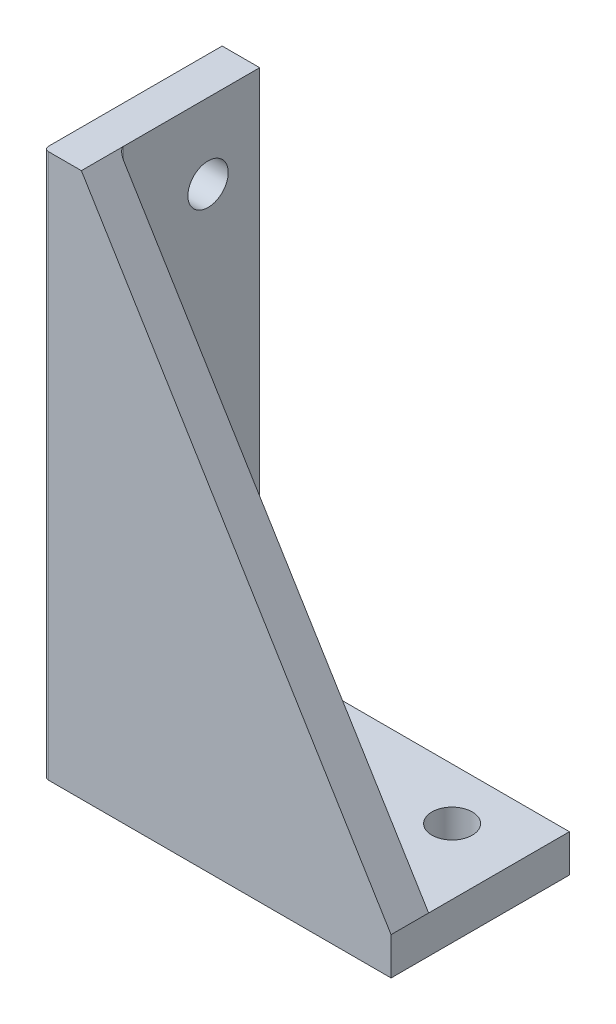
ISO-10303-21;
HEADER;
FILE_DESCRIPTION(('STEP AP214'),'2;1');
FILE_NAME('part.step','',(''),(''),'','','');
FILE_SCHEMA(('AUTOMOTIVE_DESIGN { 1 0 10303 214 1 1 1 1 }'));
ENDSEC;
DATA;
#1=APPLICATION_CONTEXT('core data for automotive mechanical design processes');
#2=APPLICATION_PROTOCOL_DEFINITION('international standard','automotive_design',2000,#1);
#3=PRODUCT_CONTEXT('',#1,'mechanical');
#4=PRODUCT('Part','Part','',(#3));
#5=PRODUCT_RELATED_PRODUCT_CATEGORY('part','',(#4));
#6=PRODUCT_DEFINITION_FORMATION('','',#4);
#7=PRODUCT_DEFINITION_CONTEXT('part definition',#1,'design');
#8=PRODUCT_DEFINITION('design','',#6,#7);
#9=PRODUCT_DEFINITION_SHAPE('','',#8);
#10=(LENGTH_UNIT() NAMED_UNIT(*) SI_UNIT(.MILLI.,.METRE.));
#11=(NAMED_UNIT(*) PLANE_ANGLE_UNIT() SI_UNIT($,.RADIAN.));
#12=(NAMED_UNIT(*) SI_UNIT($,.STERADIAN.) SOLID_ANGLE_UNIT());
#13=UNCERTAINTY_MEASURE_WITH_UNIT(LENGTH_MEASURE(1.E-05),#10,'distance_accuracy_value','');
#14=(GEOMETRIC_REPRESENTATION_CONTEXT(3) GLOBAL_UNCERTAINTY_ASSIGNED_CONTEXT((#13)) GLOBAL_UNIT_ASSIGNED_CONTEXT((#10,
#11,#12)) REPRESENTATION_CONTEXT('',''));
#15=CARTESIAN_POINT('',(0.,0.,0.));
#16=DIRECTION('',(0.,0.,1.));
#17=DIRECTION('',(1.,0.,0.));
#18=AXIS2_PLACEMENT_3D('',#15,#16,#17);
#19=CARTESIAN_POINT('',(37.,0.,30.));
#20=DIRECTION('',(-1.,0.,0.));
#21=DIRECTION('',(0.,0.,1.));
#22=AXIS2_PLACEMENT_3D('',#19,#20,#21);
#23=PLANE('',#22);
#24=DIRECTION('',(0.,0.,-1.));
#25=VECTOR('',#24,1.);
#26=CARTESIAN_POINT('',(37.,4.,59.));
#27=LINE('',#26,#25);
#28=CARTESIAN_POINT('',(37.,4.,17.));
#29=VERTEX_POINT('',#28);
#30=CARTESIAN_POINT('',(37.,4.,13.));
#31=VERTEX_POINT('',#30);
#32=EDGE_CURVE('E169',#29,#31,#27,.T.);
#33=ORIENTED_EDGE('',*,*,#32,.F.);
#34=DIRECTION('',(0.,1.,0.));
#35=VECTOR('',#34,1.);
#36=CARTESIAN_POINT('',(37.,-6.,17.));
#37=LINE('',#36,#35);
#38=CARTESIAN_POINT('',(37.,0.,17.));
#39=VERTEX_POINT('',#38);
#40=EDGE_CURVE('E138',#39,#29,#37,.T.);
#41=ORIENTED_EDGE('',*,*,#40,.F.);
#42=DIRECTION('',(0.,0.,-1.));
#43=VECTOR('',#42,1.);
#44=CARTESIAN_POINT('',(37.,0.,30.));
#45=LINE('',#44,#43);
#46=CARTESIAN_POINT('',(37.,0.,-2.));
#47=VERTEX_POINT('',#46);
#48=EDGE_CURVE('E185',#39,#47,#45,.T.);
#49=ORIENTED_EDGE('',*,*,#48,.T.);
#50=DIRECTION('',(0.,-1.,0.));
#51=VECTOR('',#50,1.);
#52=CARTESIAN_POINT('',(37.,0.,-2.));
#53=LINE('',#52,#51);
#54=CARTESIAN_POINT('',(37.,4.,-2.));
#55=VERTEX_POINT('',#54);
#56=EDGE_CURVE('E122',#55,#47,#53,.T.);
#57=ORIENTED_EDGE('',*,*,#56,.F.);
#58=DIRECTION('',(0.,0.,-1.));
#59=VECTOR('',#58,1.);
#60=CARTESIAN_POINT('',(37.,4.,0.));
#61=LINE('',#60,#59);
#62=EDGE_CURVE('E118',#31,#55,#61,.T.);
#63=ORIENTED_EDGE('',*,*,#62,.F.);
#64=EDGE_LOOP('',(#33,#41,#49,#57,#63));
#65=FACE_BOUND('',#64,.T.);
#66=ADVANCED_FACE('F34',(#65),#23,.F.);
#67=CARTESIAN_POINT('',(0.,58.,30.));
#68=DIRECTION('',(0.,-1.,0.));
#69=DIRECTION('',(0.,0.,-1.));
#70=AXIS2_PLACEMENT_3D('',#67,#68,#69);
#71=PLANE('',#70);
#72=DIRECTION('',(0.,0.,-1.));
#73=VECTOR('',#72,1.);
#74=CARTESIAN_POINT('',(0.,58.,30.));
#75=LINE('',#74,#73);
#76=CARTESIAN_POINT('',(0.,58.,16.5));
#77=VERTEX_POINT('',#76);
#78=CARTESIAN_POINT('',(0.,58.,-2.));
#79=VERTEX_POINT('',#78);
#80=EDGE_CURVE('E182',#77,#79,#75,.T.);
#81=ORIENTED_EDGE('',*,*,#80,.F.);
#82=CARTESIAN_POINT('',(0.5,58.,16.5));
#83=DIRECTION('',(0.,-1.,0.));
#84=DIRECTION('',(0.,0.,-1.));
#85=AXIS2_PLACEMENT_3D('',#82,#83,#84);
#86=CIRCLE('',#85,0.5);
#87=CARTESIAN_POINT('',(0.5,58.,17.));
#88=VERTEX_POINT('',#87);
#89=EDGE_CURVE('E192',#77,#88,#86,.F.);
#90=ORIENTED_EDGE('',*,*,#89,.T.);
#91=DIRECTION('',(-1.,0.,0.));
#92=VECTOR('',#91,1.);
#93=CARTESIAN_POINT('',(0.,58.,17.));
#94=LINE('',#93,#92);
#95=CARTESIAN_POINT('',(4.00000000000001,58.,17.));
#96=VERTEX_POINT('',#95);
#97=EDGE_CURVE('E176',#96,#88,#94,.T.);
#98=ORIENTED_EDGE('',*,*,#97,.F.);
#99=DIRECTION('',(0.,0.,-1.));
#100=VECTOR('',#99,1.);
#101=CARTESIAN_POINT('',(4.,58.,59.));
#102=LINE('',#101,#100);
#103=CARTESIAN_POINT('',(4.,58.,12.5));
#104=VERTEX_POINT('',#103);
#105=EDGE_CURVE('E49',#96,#104,#102,.T.);
#106=ORIENTED_EDGE('',*,*,#105,.T.);
#107=DIRECTION('',(0.,0.,1.));
#108=VECTOR('',#107,1.);
#109=CARTESIAN_POINT('',(4.,58.,0.));
#110=LINE('',#109,#108);
#111=CARTESIAN_POINT('',(4.,58.,-2.));
#112=VERTEX_POINT('',#111);
#113=EDGE_CURVE('E111',#112,#104,#110,.T.);
#114=ORIENTED_EDGE('',*,*,#113,.F.);
#115=DIRECTION('',(1.,0.,0.));
#116=VECTOR('',#115,1.);
#117=CARTESIAN_POINT('',(4.,58.,-2.));
#118=LINE('',#117,#116);
#119=EDGE_CURVE('E128',#79,#112,#118,.T.);
#120=ORIENTED_EDGE('',*,*,#119,.F.);
#121=EDGE_LOOP('',(#81,#90,#98,#106,#114,#120));
#122=FACE_BOUND('',#121,.T.);
#123=ADVANCED_FACE('F226',(#122),#71,.F.);
#124=CARTESIAN_POINT('',(0.,4.,13.));
#125=DIRECTION('',(0.,0.,-1.));
#126=DIRECTION('',(-1.,0.,0.));
#127=AXIS2_PLACEMENT_3D('',#124,#125,#126);
#128=PLANE('',#127);
#129=DIRECTION('',(-1.,0.,0.));
#130=VECTOR('',#129,1.);
#131=CARTESIAN_POINT('',(0.,4.,13.));
#132=LINE('',#131,#130);
#133=CARTESIAN_POINT('',(4.5,4.,13.));
#134=VERTEX_POINT('',#133);
#135=EDGE_CURVE('E110',#31,#134,#132,.T.);
#136=ORIENTED_EDGE('',*,*,#135,.T.);
#137=DIRECTION('',(0.,1.,0.));
#138=VECTOR('',#137,1.);
#139=CARTESIAN_POINT('',(4.5,4.,13.));
#140=LINE('',#139,#138);
#141=CARTESIAN_POINT('',(4.5,57.1818181818182,13.));
#142=VERTEX_POINT('',#141);
#143=EDGE_CURVE('E198',#134,#142,#140,.T.);
#144=ORIENTED_EDGE('',*,*,#143,.T.);
#145=DIRECTION('',(0.521450009453975,-0.853281833651959,0.));
#146=VECTOR('',#145,1.);
#147=CARTESIAN_POINT('',(4.,58.,13.));
#148=LINE('',#147,#146);
#149=EDGE_CURVE('E167',#142,#31,#148,.T.);
#150=ORIENTED_EDGE('',*,*,#149,.T.);
#151=EDGE_LOOP('',(#136,#144,#150));
#152=FACE_BOUND('',#151,.T.);
#153=ADVANCED_FACE('F204',(#152),#128,.T.);
#154=CARTESIAN_POINT('',(0.,4.,17.));
#155=DIRECTION('',(0.,0.,-1.));
#156=DIRECTION('',(-1.,0.,0.));
#157=AXIS2_PLACEMENT_3D('',#154,#155,#156);
#158=PLANE('',#157);
#159=ORIENTED_EDGE('',*,*,#97,.T.);
#160=DIRECTION('',(0.,1.,0.));
#161=VECTOR('',#160,1.);
#162=CARTESIAN_POINT('',(0.5,4.,17.));
#163=LINE('',#162,#161);
#164=CARTESIAN_POINT('',(0.5,0.,17.));
#165=VERTEX_POINT('',#164);
#166=EDGE_CURVE('E194',#88,#165,#163,.F.);
#167=ORIENTED_EDGE('',*,*,#166,.T.);
#168=DIRECTION('',(-1.,0.,0.));
#169=VECTOR('',#168,1.);
#170=CARTESIAN_POINT('',(0.,0.,17.));
#171=LINE('',#170,#169);
#172=EDGE_CURVE('E140',#39,#165,#171,.T.);
#173=ORIENTED_EDGE('',*,*,#172,.F.);
#174=ORIENTED_EDGE('',*,*,#40,.T.);
#175=DIRECTION('',(0.521450009453975,-0.853281833651959,0.));
#176=VECTOR('',#175,1.);
#177=CARTESIAN_POINT('',(26.9393258426966,20.4629213483146,17.));
#178=LINE('',#177,#176);
#179=EDGE_CURVE('E173',#96,#29,#178,.T.);
#180=ORIENTED_EDGE('',*,*,#179,.F.);
#181=EDGE_LOOP('',(#159,#167,#173,#174,#180));
#182=FACE_BOUND('',#181,.T.);
#183=ADVANCED_FACE('F228',(#182),#158,.F.);
#184=CARTESIAN_POINT('',(0.,0.,30.));
#185=DIRECTION('',(1.,0.,0.));
#186=DIRECTION('',(0.,0.,-1.));
#187=AXIS2_PLACEMENT_3D('',#184,#185,#186);
#188=PLANE('',#187);
#189=CARTESIAN_POINT('',(0.,14.,3.5));
#190=DIRECTION('',(1.,0.,0.));
#191=DIRECTION('',(0.,0.,-1.));
#192=AXIS2_PLACEMENT_3D('',#189,#190,#191);
#193=CIRCLE('',#192,2.15);
#194=CARTESIAN_POINT('',(0.,14.,1.35));
#195=VERTEX_POINT('',#194);
#196=EDGE_CURVE('E158',#195,#195,#193,.T.);
#197=ORIENTED_EDGE('',*,*,#196,.T.);
#198=EDGE_LOOP('',(#197));
#199=FACE_BOUND('',#198,.T.);
#200=CARTESIAN_POINT('',(0.,50.,3.5));
#201=DIRECTION('',(1.,0.,0.));
#202=DIRECTION('',(0.,0.,-1.));
#203=AXIS2_PLACEMENT_3D('',#200,#201,#202);
#204=CIRCLE('',#203,2.15);
#205=CARTESIAN_POINT('',(0.,50.,1.35));
#206=VERTEX_POINT('',#205);
#207=EDGE_CURVE('E164',#206,#206,#204,.T.);
#208=ORIENTED_EDGE('',*,*,#207,.T.);
#209=EDGE_LOOP('',(#208));
#210=FACE_BOUND('',#209,.T.);
#211=DIRECTION('',(0.,0.,-1.));
#212=VECTOR('',#211,1.);
#213=CARTESIAN_POINT('',(0.,0.,30.));
#214=LINE('',#213,#212);
#215=CARTESIAN_POINT('',(0.,0.,16.5));
#216=VERTEX_POINT('',#215);
#217=CARTESIAN_POINT('',(0.,0.,-2.));
#218=VERTEX_POINT('',#217);
#219=EDGE_CURVE('E187',#216,#218,#214,.T.);
#220=ORIENTED_EDGE('',*,*,#219,.F.);
#221=DIRECTION('',(0.,1.,0.));
#222=VECTOR('',#221,1.);
#223=CARTESIAN_POINT('',(0.,0.,16.5));
#224=LINE('',#223,#222);
#225=EDGE_CURVE('E189',#216,#77,#224,.T.);
#226=ORIENTED_EDGE('',*,*,#225,.T.);
#227=ORIENTED_EDGE('',*,*,#80,.T.);
#228=DIRECTION('',(0.,1.,0.));
#229=VECTOR('',#228,1.);
#230=CARTESIAN_POINT('',(0.,58.,-2.));
#231=LINE('',#230,#229);
#232=EDGE_CURVE('E135',#218,#79,#231,.T.);
#233=ORIENTED_EDGE('',*,*,#232,.F.);
#234=EDGE_LOOP('',(#220,#226,#227,#233));
#235=FACE_BOUND('',#234,.T.);
#236=ADVANCED_FACE('F221',(#199,#210,#235),#188,.F.);
#237=CARTESIAN_POINT('',(0.,0.,30.));
#238=DIRECTION('',(0.,1.,0.));
#239=DIRECTION('',(0.,0.,1.));
#240=AXIS2_PLACEMENT_3D('',#237,#238,#239);
#241=PLANE('',#240);
#242=CARTESIAN_POINT('',(12.,0.,3.5));
#243=DIRECTION('',(0.,1.,0.));
#244=DIRECTION('',(0.,0.,1.));
#245=AXIS2_PLACEMENT_3D('',#242,#243,#244);
#246=CIRCLE('',#245,2.15);
#247=CARTESIAN_POINT('',(12.,0.,5.65));
#248=VERTEX_POINT('',#247);
#249=EDGE_CURVE('E146',#248,#248,#246,.T.);
#250=ORIENTED_EDGE('',*,*,#249,.T.);
#251=EDGE_LOOP('',(#250));
#252=FACE_BOUND('',#251,.T.);
#253=CARTESIAN_POINT('',(30.,0.,3.5));
#254=DIRECTION('',(0.,1.,0.));
#255=DIRECTION('',(0.,0.,1.));
#256=AXIS2_PLACEMENT_3D('',#253,#254,#255);
#257=CIRCLE('',#256,2.15);
#258=CARTESIAN_POINT('',(30.,0.,5.65));
#259=VERTEX_POINT('',#258);
#260=EDGE_CURVE('E152',#259,#259,#257,.T.);
#261=ORIENTED_EDGE('',*,*,#260,.T.);
#262=EDGE_LOOP('',(#261));
#263=FACE_BOUND('',#262,.T.);
#264=ORIENTED_EDGE('',*,*,#172,.T.);
#265=CARTESIAN_POINT('',(0.5,0.,16.5));
#266=DIRECTION('',(0.,1.,0.));
#267=DIRECTION('',(0.,0.,1.));
#268=AXIS2_PLACEMENT_3D('',#265,#266,#267);
#269=CIRCLE('',#268,0.5);
#270=EDGE_CURVE('E196',#165,#216,#269,.F.);
#271=ORIENTED_EDGE('',*,*,#270,.T.);
#272=ORIENTED_EDGE('',*,*,#219,.T.);
#273=DIRECTION('',(-1.,0.,0.));
#274=VECTOR('',#273,1.);
#275=CARTESIAN_POINT('',(0.,0.,-2.));
#276=LINE('',#275,#274);
#277=EDGE_CURVE('E132',#47,#218,#276,.T.);
#278=ORIENTED_EDGE('',*,*,#277,.F.);
#279=ORIENTED_EDGE('',*,*,#48,.F.);
#280=EDGE_LOOP('',(#264,#271,#272,#278,#279));
#281=FACE_BOUND('',#280,.T.);
#282=ADVANCED_FACE('F216',(#252,#263,#281),#241,.F.);
#283=CARTESIAN_POINT('',(4.,4.,0.));
#284=DIRECTION('',(-1.,0.,0.));
#285=DIRECTION('',(0.,0.,1.));
#286=AXIS2_PLACEMENT_3D('',#283,#284,#285);
#287=PLANE('',#286);
#288=CARTESIAN_POINT('',(4.,14.,3.5));
#289=DIRECTION('',(1.,0.,0.));
#290=DIRECTION('',(0.,0.,-1.));
#291=AXIS2_PLACEMENT_3D('',#288,#289,#290);
#292=CIRCLE('',#291,2.14999999999999);
#293=CARTESIAN_POINT('',(4.,14.,1.35000000000001));
#294=VERTEX_POINT('',#293);
#295=EDGE_CURVE('E155',#294,#294,#292,.T.);
#296=ORIENTED_EDGE('',*,*,#295,.F.);
#297=EDGE_LOOP('',(#296));
#298=FACE_BOUND('',#297,.T.);
#299=CARTESIAN_POINT('',(4.,50.,3.5));
#300=DIRECTION('',(1.,0.,0.));
#301=DIRECTION('',(0.,0.,-1.));
#302=AXIS2_PLACEMENT_3D('',#299,#300,#301);
#303=CIRCLE('',#302,2.14999999999999);
#304=CARTESIAN_POINT('',(4.,50.,1.35000000000001));
#305=VERTEX_POINT('',#304);
#306=EDGE_CURVE('E161',#305,#305,#303,.T.);
#307=ORIENTED_EDGE('',*,*,#306,.F.);
#308=EDGE_LOOP('',(#307));
#309=FACE_BOUND('',#308,.T.);
#310=ORIENTED_EDGE('',*,*,#113,.T.);
#311=DIRECTION('',(0.,1.,0.));
#312=VECTOR('',#311,1.);
#313=CARTESIAN_POINT('',(4.,4.,12.5));
#314=LINE('',#313,#312);
#315=CARTESIAN_POINT('',(4.,4.,12.5));
#316=VERTEX_POINT('',#315);
#317=EDGE_CURVE('E56',#104,#316,#314,.F.);
#318=ORIENTED_EDGE('',*,*,#317,.T.);
#319=DIRECTION('',(0.,0.,1.));
#320=VECTOR('',#319,1.);
#321=CARTESIAN_POINT('',(4.,4.,0.));
#322=LINE('',#321,#320);
#323=CARTESIAN_POINT('',(4.,4.,-2.));
#324=VERTEX_POINT('',#323);
#325=EDGE_CURVE('E103',#324,#316,#322,.T.);
#326=ORIENTED_EDGE('',*,*,#325,.F.);
#327=DIRECTION('',(0.,-1.,0.));
#328=VECTOR('',#327,1.);
#329=CARTESIAN_POINT('',(4.,4.,-2.));
#330=LINE('',#329,#328);
#331=EDGE_CURVE('E107',#112,#324,#330,.T.);
#332=ORIENTED_EDGE('',*,*,#331,.F.);
#333=EDGE_LOOP('',(#310,#318,#326,#332));
#334=FACE_BOUND('',#333,.T.);
#335=ADVANCED_FACE('F105',(#298,#309,#334),#287,.F.);
#336=CARTESIAN_POINT('',(0.,4.,0.));
#337=DIRECTION('',(0.,1.,0.));
#338=DIRECTION('',(0.,0.,1.));
#339=AXIS2_PLACEMENT_3D('',#336,#337,#338);
#340=PLANE('',#339);
#341=CARTESIAN_POINT('',(12.,4.,3.5));
#342=DIRECTION('',(0.,1.,0.));
#343=DIRECTION('',(0.,0.,1.));
#344=AXIS2_PLACEMENT_3D('',#341,#342,#343);
#345=CIRCLE('',#344,2.14999999999999);
#346=CARTESIAN_POINT('',(12.,4.,5.64999999999999));
#347=VERTEX_POINT('',#346);
#348=EDGE_CURVE('E143',#347,#347,#345,.T.);
#349=ORIENTED_EDGE('',*,*,#348,.F.);
#350=EDGE_LOOP('',(#349));
#351=FACE_BOUND('',#350,.T.);
#352=CARTESIAN_POINT('',(30.,4.,3.5));
#353=DIRECTION('',(0.,1.,0.));
#354=DIRECTION('',(0.,0.,1.));
#355=AXIS2_PLACEMENT_3D('',#352,#353,#354);
#356=CIRCLE('',#355,2.14999999999999);
#357=CARTESIAN_POINT('',(30.,4.,5.64999999999999));
#358=VERTEX_POINT('',#357);
#359=EDGE_CURVE('E149',#358,#358,#356,.T.);
#360=ORIENTED_EDGE('',*,*,#359,.F.);
#361=EDGE_LOOP('',(#360));
#362=FACE_BOUND('',#361,.T.);
#363=ORIENTED_EDGE('',*,*,#325,.T.);
#364=CARTESIAN_POINT('',(4.5,4.,12.5));
#365=DIRECTION('',(0.,1.,0.));
#366=DIRECTION('',(0.,0.,1.));
#367=AXIS2_PLACEMENT_3D('',#364,#365,#366);
#368=CIRCLE('',#367,0.5);
#369=EDGE_CURVE('E42',#316,#134,#368,.T.);
#370=ORIENTED_EDGE('',*,*,#369,.T.);
#371=ORIENTED_EDGE('',*,*,#135,.F.);
#372=ORIENTED_EDGE('',*,*,#62,.T.);
#373=DIRECTION('',(1.,0.,0.));
#374=VECTOR('',#373,1.);
#375=CARTESIAN_POINT('',(37.,4.,-2.));
#376=LINE('',#375,#374);
#377=EDGE_CURVE('E114',#324,#55,#376,.T.);
#378=ORIENTED_EDGE('',*,*,#377,.F.);
#379=EDGE_LOOP('',(#363,#370,#371,#372,#378));
#380=FACE_BOUND('',#379,.T.);
#381=ADVANCED_FACE('F115',(#351,#362,#380),#340,.T.);
#382=CARTESIAN_POINT('',(4.,58.,59.));
#383=DIRECTION('',(0.853281833651959,0.521450009453975,0.));
#384=DIRECTION('',(-0.521450009453975,0.853281833651959,0.));
#385=AXIS2_PLACEMENT_3D('',#382,#383,#384);
#386=PLANE('',#385);
#387=ORIENTED_EDGE('',*,*,#179,.T.);
#388=ORIENTED_EDGE('',*,*,#32,.T.);
#389=ORIENTED_EDGE('',*,*,#149,.F.);
#390=CARTESIAN_POINT('',(4.5,57.1818181818182,12.5));
#391=DIRECTION('',(0.853281833651959,0.521450009453975,0.));
#392=DIRECTION('',(-0.521450009453975,0.853281833651959,0.));
#393=AXIS2_PLACEMENT_3D('',#390,#391,#392);
#394=ELLIPSE('',#393,0.958864686805863,0.5);
#395=EDGE_CURVE('E11',#142,#104,#394,.F.);
#396=ORIENTED_EDGE('',*,*,#395,.T.);
#397=ORIENTED_EDGE('',*,*,#105,.F.);
#398=EDGE_LOOP('',(#387,#388,#389,#396,#397));
#399=FACE_BOUND('',#398,.T.);
#400=ADVANCED_FACE('F207',(#399),#386,.T.);
#401=CARTESIAN_POINT('',(4.,50.,3.5));
#402=DIRECTION('',(1.,0.,0.));
#403=DIRECTION('',(0.,0.,-1.));
#404=AXIS2_PLACEMENT_3D('',#401,#402,#403);
#405=CYLINDRICAL_SURFACE('',#404,2.14999999999999);
#406=ORIENTED_EDGE('',*,*,#207,.F.);
#407=EDGE_LOOP('',(#406));
#408=FACE_BOUND('',#407,.T.);
#409=ORIENTED_EDGE('',*,*,#306,.T.);
#410=EDGE_LOOP('',(#409));
#411=FACE_BOUND('',#410,.T.);
#412=ADVANCED_FACE('F271',(#408,#411),#405,.F.);
#413=CARTESIAN_POINT('',(4.,14.,3.5));
#414=DIRECTION('',(1.,0.,0.));
#415=DIRECTION('',(0.,0.,-1.));
#416=AXIS2_PLACEMENT_3D('',#413,#414,#415);
#417=CYLINDRICAL_SURFACE('',#416,2.14999999999999);
#418=ORIENTED_EDGE('',*,*,#196,.F.);
#419=EDGE_LOOP('',(#418));
#420=FACE_BOUND('',#419,.T.);
#421=ORIENTED_EDGE('',*,*,#295,.T.);
#422=EDGE_LOOP('',(#421));
#423=FACE_BOUND('',#422,.T.);
#424=ADVANCED_FACE('F262',(#420,#423),#417,.F.);
#425=CARTESIAN_POINT('',(30.,4.,3.5));
#426=DIRECTION('',(0.,1.,0.));
#427=DIRECTION('',(0.,0.,1.));
#428=AXIS2_PLACEMENT_3D('',#425,#426,#427);
#429=CYLINDRICAL_SURFACE('',#428,2.14999999999999);
#430=ORIENTED_EDGE('',*,*,#260,.F.);
#431=EDGE_LOOP('',(#430));
#432=FACE_BOUND('',#431,.T.);
#433=ORIENTED_EDGE('',*,*,#359,.T.);
#434=EDGE_LOOP('',(#433));
#435=FACE_BOUND('',#434,.T.);
#436=ADVANCED_FACE('F256',(#432,#435),#429,.F.);
#437=CARTESIAN_POINT('',(12.,4.,3.5));
#438=DIRECTION('',(0.,1.,0.));
#439=DIRECTION('',(0.,0.,1.));
#440=AXIS2_PLACEMENT_3D('',#437,#438,#439);
#441=CYLINDRICAL_SURFACE('',#440,2.14999999999999);
#442=ORIENTED_EDGE('',*,*,#249,.F.);
#443=EDGE_LOOP('',(#442));
#444=FACE_BOUND('',#443,.T.);
#445=ORIENTED_EDGE('',*,*,#348,.T.);
#446=EDGE_LOOP('',(#445));
#447=FACE_BOUND('',#446,.T.);
#448=ADVANCED_FACE('F251',(#444,#447),#441,.F.);
#449=CARTESIAN_POINT('',(0.5,0.,16.5));
#450=DIRECTION('',(0.,1.,0.));
#451=DIRECTION('',(0.,0.,1.));
#452=AXIS2_PLACEMENT_3D('',#449,#450,#451);
#453=CYLINDRICAL_SURFACE('',#452,0.5);
#454=ORIENTED_EDGE('',*,*,#270,.F.);
#455=ORIENTED_EDGE('',*,*,#166,.F.);
#456=ORIENTED_EDGE('',*,*,#89,.F.);
#457=ORIENTED_EDGE('',*,*,#225,.F.);
#458=EDGE_LOOP('',(#454,#455,#456,#457));
#459=FACE_BOUND('',#458,.T.);
#460=ADVANCED_FACE('F224',(#459),#453,.T.);
#461=CARTESIAN_POINT('',(4.5,4.,12.5));
#462=DIRECTION('',(0.,1.,0.));
#463=DIRECTION('',(0.,0.,1.));
#464=AXIS2_PLACEMENT_3D('',#461,#462,#463);
#465=CYLINDRICAL_SURFACE('',#464,0.5);
#466=ORIENTED_EDGE('',*,*,#369,.F.);
#467=ORIENTED_EDGE('',*,*,#317,.F.);
#468=ORIENTED_EDGE('',*,*,#395,.F.);
#469=ORIENTED_EDGE('',*,*,#143,.F.);
#470=EDGE_LOOP('',(#466,#467,#468,#469));
#471=FACE_BOUND('',#470,.T.);
#472=ADVANCED_FACE('F36',(#471),#465,.F.);
#473=CARTESIAN_POINT('',(0.,0.,-2.));
#474=DIRECTION('',(0.,0.,1.));
#475=DIRECTION('',(1.,0.,0.));
#476=AXIS2_PLACEMENT_3D('',#473,#474,#475);
#477=PLANE('',#476);
#478=ORIENTED_EDGE('',*,*,#331,.T.);
#479=ORIENTED_EDGE('',*,*,#377,.T.);
#480=ORIENTED_EDGE('',*,*,#56,.T.);
#481=ORIENTED_EDGE('',*,*,#277,.T.);
#482=ORIENTED_EDGE('',*,*,#232,.T.);
#483=ORIENTED_EDGE('',*,*,#119,.T.);
#484=EDGE_LOOP('',(#478,#479,#480,#481,#482,#483));
#485=FACE_BOUND('',#484,.T.);
#486=ADVANCED_FACE('F125',(#485),#477,.F.);
#487=CLOSED_SHELL('',(#66,#123,#153,#183,#236,#282,#335,#381,#400,#412,#424,#436,#448,#460,#472,#486));
#488=MANIFOLD_SOLID_BREP('B2',#487);
#489=ADVANCED_BREP_SHAPE_REPRESENTATION('',(#18,#488),#14);
#490=SHAPE_DEFINITION_REPRESENTATION(#9,#489);
ENDSEC;
END-ISO-10303-21;
